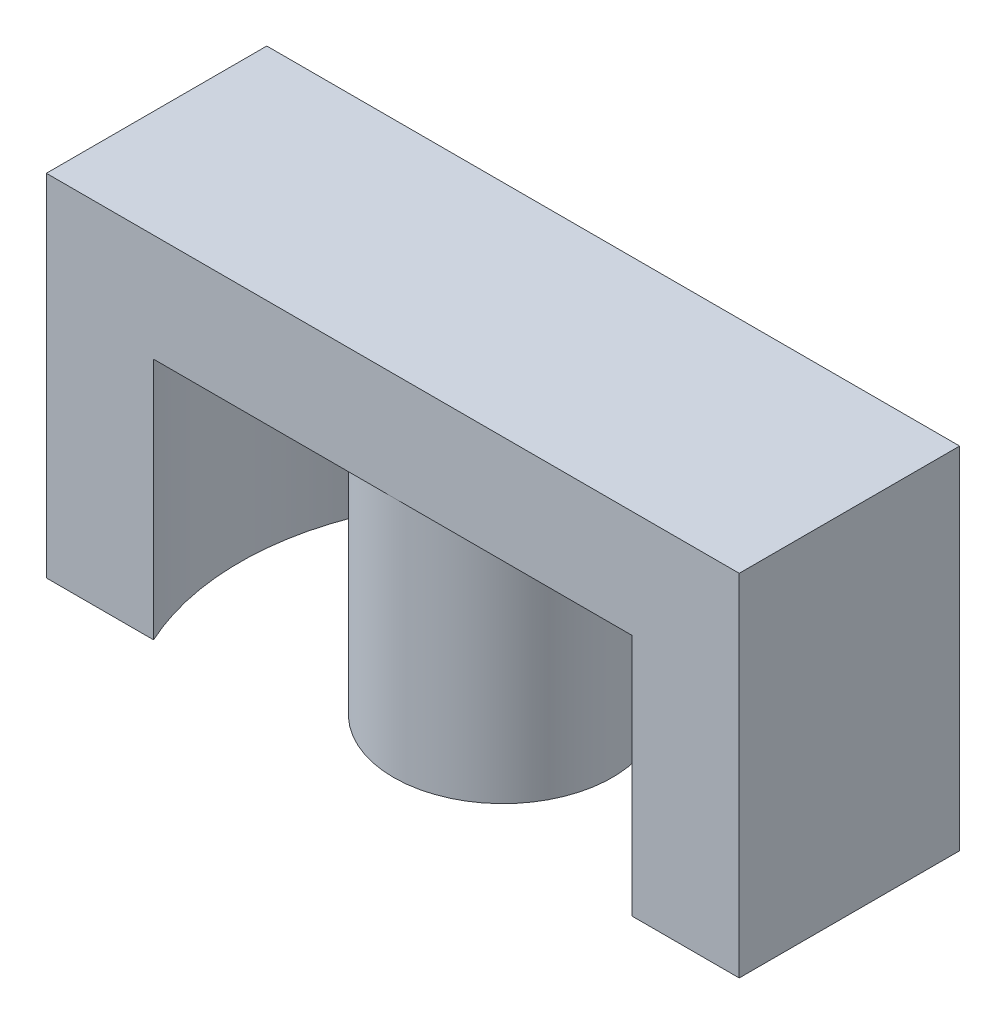
ISO-10303-21;
HEADER;
FILE_DESCRIPTION(('STEP AP214'),'2;1');
FILE_NAME('part.step','',(''),(''),'','','');
FILE_SCHEMA(('AUTOMOTIVE_DESIGN { 1 0 10303 214 1 1 1 1 }'));
ENDSEC;
DATA;
#1=APPLICATION_CONTEXT('core data for automotive mechanical design processes');
#2=APPLICATION_PROTOCOL_DEFINITION('international standard','automotive_design',2000,#1);
#3=PRODUCT_CONTEXT('',#1,'mechanical');
#4=PRODUCT('Part','Part','',(#3));
#5=PRODUCT_RELATED_PRODUCT_CATEGORY('part','',(#4));
#6=PRODUCT_DEFINITION_FORMATION('','',#4);
#7=PRODUCT_DEFINITION_CONTEXT('part definition',#1,'design');
#8=PRODUCT_DEFINITION('design','',#6,#7);
#9=PRODUCT_DEFINITION_SHAPE('','',#8);
#10=(LENGTH_UNIT() NAMED_UNIT(*) SI_UNIT(.MILLI.,.METRE.));
#11=(NAMED_UNIT(*) PLANE_ANGLE_UNIT() SI_UNIT($,.RADIAN.));
#12=(NAMED_UNIT(*) SI_UNIT($,.STERADIAN.) SOLID_ANGLE_UNIT());
#13=UNCERTAINTY_MEASURE_WITH_UNIT(LENGTH_MEASURE(1.E-05),#10,'distance_accuracy_value','');
#14=(GEOMETRIC_REPRESENTATION_CONTEXT(3) GLOBAL_UNCERTAINTY_ASSIGNED_CONTEXT((#13)) GLOBAL_UNIT_ASSIGNED_CONTEXT((#10,
#11,#12)) REPRESENTATION_CONTEXT('',''));
#15=CARTESIAN_POINT('',(0.,0.,0.));
#16=DIRECTION('',(0.,0.,1.));
#17=DIRECTION('',(1.,0.,0.));
#18=AXIS2_PLACEMENT_3D('',#15,#16,#17);
#19=CARTESIAN_POINT('',(0.,-17.3,0.));
#20=DIRECTION('',(0.,1.,0.));
#21=DIRECTION('',(0.,0.,1.));
#22=AXIS2_PLACEMENT_3D('',#19,#20,#21);
#23=PLANE('',#22);
#24=DIRECTION('',(1.,0.,0.));
#25=VECTOR('',#24,1.);
#26=CARTESIAN_POINT('',(-17.1,-17.3,5.44));
#27=LINE('',#26,#25);
#28=CARTESIAN_POINT('',(-17.1,-17.3,5.44));
#29=VERTEX_POINT('',#28);
#30=CARTESIAN_POINT('',(-11.8070487421709,-17.3,5.44000000000001));
#31=VERTEX_POINT('',#30);
#32=EDGE_CURVE('E91',#29,#31,#27,.T.);
#33=ORIENTED_EDGE('',*,*,#32,.F.);
#34=DIRECTION('',(0.,0.,1.));
#35=VECTOR('',#34,1.);
#36=CARTESIAN_POINT('',(-17.1,-17.3,-5.44));
#37=LINE('',#36,#35);
#38=CARTESIAN_POINT('',(-17.1,-17.3,-5.44));
#39=VERTEX_POINT('',#38);
#40=EDGE_CURVE('E86',#39,#29,#37,.T.);
#41=ORIENTED_EDGE('',*,*,#40,.F.);
#42=DIRECTION('',(-1.,0.,0.));
#43=VECTOR('',#42,1.);
#44=CARTESIAN_POINT('',(17.1,-17.3,-5.44));
#45=LINE('',#44,#43);
#46=CARTESIAN_POINT('',(-11.8070487421709,-17.3,-5.44));
#47=VERTEX_POINT('',#46);
#48=EDGE_CURVE('E89',#47,#39,#45,.T.);
#49=ORIENTED_EDGE('',*,*,#48,.F.);
#50=CARTESIAN_POINT('',(0.,-17.3,0.));
#51=DIRECTION('',(0.,-1.,0.));
#52=DIRECTION('',(0.,0.,-1.));
#53=AXIS2_PLACEMENT_3D('',#50,#51,#52);
#54=CIRCLE('',#53,13.);
#55=EDGE_CURVE('E116',#47,#31,#54,.F.);
#56=ORIENTED_EDGE('',*,*,#55,.T.);
#57=EDGE_LOOP('',(#33,#41,#49,#56));
#58=FACE_BOUND('',#57,.T.);
#59=ADVANCED_FACE('F16',(#58),#23,.F.);
#60=CARTESIAN_POINT('',(-17.1,-17.3,-5.44));
#61=DIRECTION('',(-1.,0.,0.));
#62=DIRECTION('',(0.,0.,1.));
#63=AXIS2_PLACEMENT_3D('',#60,#61,#62);
#64=PLANE('',#63);
#65=ORIENTED_EDGE('',*,*,#40,.T.);
#66=DIRECTION('',(0.,1.,0.));
#67=VECTOR('',#66,1.);
#68=CARTESIAN_POINT('',(-17.1,-17.3,5.44));
#69=LINE('',#68,#67);
#70=CARTESIAN_POINT('',(-17.1,0.,5.44));
#71=VERTEX_POINT('',#70);
#72=EDGE_CURVE('E117',#71,#29,#69,.F.);
#73=ORIENTED_EDGE('',*,*,#72,.F.);
#74=DIRECTION('',(0.,0.,1.));
#75=VECTOR('',#74,1.);
#76=CARTESIAN_POINT('',(-17.1,0.,0.));
#77=LINE('',#76,#75);
#78=CARTESIAN_POINT('',(-17.1,0.,-5.44));
#79=VERTEX_POINT('',#78);
#80=EDGE_CURVE('E95',#79,#71,#77,.T.);
#81=ORIENTED_EDGE('',*,*,#80,.F.);
#82=DIRECTION('',(0.,1.,0.));
#83=VECTOR('',#82,1.);
#84=CARTESIAN_POINT('',(-17.1,-17.3,-5.44));
#85=LINE('',#84,#83);
#86=EDGE_CURVE('E98',#39,#79,#85,.T.);
#87=ORIENTED_EDGE('',*,*,#86,.F.);
#88=EDGE_LOOP('',(#65,#73,#81,#87));
#89=FACE_BOUND('',#88,.T.);
#90=ADVANCED_FACE('F99',(#89),#64,.T.);
#91=CARTESIAN_POINT('',(0.,0.,0.));
#92=DIRECTION('',(0.,1.,0.));
#93=DIRECTION('',(0.,0.,1.));
#94=AXIS2_PLACEMENT_3D('',#91,#92,#93);
#95=PLANE('',#94);
#96=ORIENTED_EDGE('',*,*,#80,.T.);
#97=DIRECTION('',(1.,0.,0.));
#98=VECTOR('',#97,1.);
#99=CARTESIAN_POINT('',(-17.1,0.,5.44));
#100=LINE('',#99,#98);
#101=CARTESIAN_POINT('',(17.1,0.,5.44));
#102=VERTEX_POINT('',#101);
#103=EDGE_CURVE('E121',#102,#71,#100,.F.);
#104=ORIENTED_EDGE('',*,*,#103,.F.);
#105=DIRECTION('',(0.,0.,-1.));
#106=VECTOR('',#105,1.);
#107=CARTESIAN_POINT('',(17.1,0.,5.44));
#108=LINE('',#107,#106);
#109=CARTESIAN_POINT('',(17.1,0.,-5.44));
#110=VERTEX_POINT('',#109);
#111=EDGE_CURVE('E163',#110,#102,#108,.F.);
#112=ORIENTED_EDGE('',*,*,#111,.F.);
#113=DIRECTION('',(-1.,0.,0.));
#114=VECTOR('',#113,1.);
#115=CARTESIAN_POINT('',(17.1,0.,-5.44));
#116=LINE('',#115,#114);
#117=EDGE_CURVE('E103',#79,#110,#116,.F.);
#118=ORIENTED_EDGE('',*,*,#117,.F.);
#119=EDGE_LOOP('',(#96,#104,#112,#118));
#120=FACE_BOUND('',#119,.T.);
#121=ADVANCED_FACE('F182',(#120),#95,.T.);
#122=CARTESIAN_POINT('',(17.1,-17.3,5.44));
#123=DIRECTION('',(1.,0.,0.));
#124=DIRECTION('',(0.,0.,-1.));
#125=AXIS2_PLACEMENT_3D('',#122,#123,#124);
#126=PLANE('',#125);
#127=DIRECTION('',(0.,0.,1.));
#128=VECTOR('',#127,1.);
#129=CARTESIAN_POINT('',(17.1,-17.3,0.));
#130=LINE('',#129,#128);
#131=CARTESIAN_POINT('',(17.1,-17.3,5.44));
#132=VERTEX_POINT('',#131);
#133=CARTESIAN_POINT('',(17.1,-17.3,-5.44));
#134=VERTEX_POINT('',#133);
#135=EDGE_CURVE('E65',#132,#134,#130,.F.);
#136=ORIENTED_EDGE('',*,*,#135,.T.);
#137=DIRECTION('',(0.,1.,0.));
#138=VECTOR('',#137,1.);
#139=CARTESIAN_POINT('',(17.1,-17.3,-5.44));
#140=LINE('',#139,#138);
#141=EDGE_CURVE('E159',#110,#134,#140,.F.);
#142=ORIENTED_EDGE('',*,*,#141,.F.);
#143=ORIENTED_EDGE('',*,*,#111,.T.);
#144=DIRECTION('',(0.,1.,0.));
#145=VECTOR('',#144,1.);
#146=CARTESIAN_POINT('',(17.1,-17.3,5.44));
#147=LINE('',#146,#145);
#148=EDGE_CURVE('E126',#132,#102,#147,.T.);
#149=ORIENTED_EDGE('',*,*,#148,.F.);
#150=EDGE_LOOP('',(#136,#142,#143,#149));
#151=FACE_BOUND('',#150,.T.);
#152=ADVANCED_FACE('F185',(#151),#126,.T.);
#153=CARTESIAN_POINT('',(0.,-17.3,0.));
#154=DIRECTION('',(0.,1.,0.));
#155=DIRECTION('',(0.,0.,1.));
#156=AXIS2_PLACEMENT_3D('',#153,#154,#155);
#157=PLANE('',#156);
#158=DIRECTION('',(-1.,0.,0.));
#159=VECTOR('',#158,1.);
#160=CARTESIAN_POINT('',(17.1,-17.3,-5.44));
#161=LINE('',#160,#159);
#162=CARTESIAN_POINT('',(11.8070487421709,-17.3,-5.44));
#163=VERTEX_POINT('',#162);
#164=EDGE_CURVE('E157',#134,#163,#161,.T.);
#165=ORIENTED_EDGE('',*,*,#164,.F.);
#166=ORIENTED_EDGE('',*,*,#135,.F.);
#167=DIRECTION('',(1.,0.,0.));
#168=VECTOR('',#167,1.);
#169=CARTESIAN_POINT('',(-17.1,-17.3,5.44));
#170=LINE('',#169,#168);
#171=CARTESIAN_POINT('',(11.8070487421709,-17.3,5.44));
#172=VERTEX_POINT('',#171);
#173=EDGE_CURVE('E131',#172,#132,#170,.T.);
#174=ORIENTED_EDGE('',*,*,#173,.F.);
#175=CARTESIAN_POINT('',(0.,-17.3,0.));
#176=DIRECTION('',(0.,-1.,0.));
#177=DIRECTION('',(0.,0.,-1.));
#178=AXIS2_PLACEMENT_3D('',#175,#176,#177);
#179=CIRCLE('',#178,13.);
#180=EDGE_CURVE('E19',#172,#163,#179,.F.);
#181=ORIENTED_EDGE('',*,*,#180,.T.);
#182=EDGE_LOOP('',(#165,#166,#174,#181));
#183=FACE_BOUND('',#182,.T.);
#184=ADVANCED_FACE('F188',(#183),#157,.F.);
#185=CARTESIAN_POINT('',(0.,-51.6133889928172,0.));
#186=DIRECTION('',(0.,-1.,0.));
#187=DIRECTION('',(0.,0.,-1.));
#188=AXIS2_PLACEMENT_3D('',#185,#186,#187);
#189=CYLINDRICAL_SURFACE('',#188,13.);
#190=DIRECTION('',(0.,1.,0.));
#191=VECTOR('',#190,1.);
#192=CARTESIAN_POINT('',(11.8070487421709,-17.3,5.44));
#193=LINE('',#192,#191);
#194=CARTESIAN_POINT('',(11.8070487421709,-5.3,5.44));
#195=VERTEX_POINT('',#194);
#196=EDGE_CURVE('E136',#195,#172,#193,.F.);
#197=ORIENTED_EDGE('',*,*,#196,.F.);
#198=CARTESIAN_POINT('',(0.,-5.3,0.));
#199=DIRECTION('',(0.,-1.,0.));
#200=DIRECTION('',(0.,0.,-1.));
#201=AXIS2_PLACEMENT_3D('',#198,#199,#200);
#202=CIRCLE('',#201,13.);
#203=CARTESIAN_POINT('',(11.8070487421709,-5.3,-5.44));
#204=VERTEX_POINT('',#203);
#205=EDGE_CURVE('E146',#204,#195,#202,.T.);
#206=ORIENTED_EDGE('',*,*,#205,.F.);
#207=DIRECTION('',(0.,1.,0.));
#208=VECTOR('',#207,1.);
#209=CARTESIAN_POINT('',(11.8070487421709,-17.3,-5.44));
#210=LINE('',#209,#208);
#211=EDGE_CURVE('E148',#163,#204,#210,.T.);
#212=ORIENTED_EDGE('',*,*,#211,.F.);
#213=ORIENTED_EDGE('',*,*,#180,.F.);
#214=EDGE_LOOP('',(#197,#206,#212,#213));
#215=FACE_BOUND('',#214,.T.);
#216=ADVANCED_FACE('F189',(#215),#189,.F.);
#217=CARTESIAN_POINT('',(-17.1,-17.3,5.44));
#218=DIRECTION('',(0.,0.,1.));
#219=DIRECTION('',(1.,0.,0.));
#220=AXIS2_PLACEMENT_3D('',#217,#218,#219);
#221=PLANE('',#220);
#222=ORIENTED_EDGE('',*,*,#32,.T.);
#223=DIRECTION('',(0.,-1.,0.));
#224=VECTOR('',#223,1.);
#225=CARTESIAN_POINT('',(-11.8070487421709,-51.6133889928172,5.44000000000001));
#226=LINE('',#225,#224);
#227=CARTESIAN_POINT('',(-11.8070487421709,-5.3,5.44000000000001));
#228=VERTEX_POINT('',#227);
#229=EDGE_CURVE('E108',#31,#228,#226,.F.);
#230=ORIENTED_EDGE('',*,*,#229,.T.);
#231=DIRECTION('',(1.,0.,0.));
#232=VECTOR('',#231,1.);
#233=CARTESIAN_POINT('',(0.,-5.3,5.44));
#234=LINE('',#233,#232);
#235=EDGE_CURVE('E145',#195,#228,#234,.F.);
#236=ORIENTED_EDGE('',*,*,#235,.F.);
#237=ORIENTED_EDGE('',*,*,#196,.T.);
#238=ORIENTED_EDGE('',*,*,#173,.T.);
#239=ORIENTED_EDGE('',*,*,#148,.T.);
#240=ORIENTED_EDGE('',*,*,#103,.T.);
#241=ORIENTED_EDGE('',*,*,#72,.T.);
#242=EDGE_LOOP('',(#222,#230,#236,#237,#238,#239,#240,#241));
#243=FACE_BOUND('',#242,.T.);
#244=ADVANCED_FACE('F183',(#243),#221,.T.);
#245=CARTESIAN_POINT('',(0.,-51.6133889928172,0.));
#246=DIRECTION('',(0.,-1.,0.));
#247=DIRECTION('',(0.,0.,-1.));
#248=AXIS2_PLACEMENT_3D('',#245,#246,#247);
#249=CYLINDRICAL_SURFACE('',#248,13.);
#250=ORIENTED_EDGE('',*,*,#229,.F.);
#251=ORIENTED_EDGE('',*,*,#55,.F.);
#252=DIRECTION('',(0.,1.,0.));
#253=VECTOR('',#252,1.);
#254=CARTESIAN_POINT('',(-11.8070487421709,-17.3,-5.44));
#255=LINE('',#254,#253);
#256=CARTESIAN_POINT('',(-11.8070487421709,-5.3,-5.44));
#257=VERTEX_POINT('',#256);
#258=EDGE_CURVE('E34',#257,#47,#255,.F.);
#259=ORIENTED_EDGE('',*,*,#258,.F.);
#260=CARTESIAN_POINT('',(0.,-5.3,0.));
#261=DIRECTION('',(0.,-1.,0.));
#262=DIRECTION('',(0.,0.,-1.));
#263=AXIS2_PLACEMENT_3D('',#260,#261,#262);
#264=CIRCLE('',#263,13.);
#265=EDGE_CURVE('E142',#228,#257,#264,.T.);
#266=ORIENTED_EDGE('',*,*,#265,.F.);
#267=EDGE_LOOP('',(#250,#251,#259,#266));
#268=FACE_BOUND('',#267,.T.);
#269=ADVANCED_FACE('F197',(#268),#249,.F.);
#270=CARTESIAN_POINT('',(17.1,-17.3,-5.44));
#271=DIRECTION('',(0.,0.,-1.));
#272=DIRECTION('',(-1.,0.,0.));
#273=AXIS2_PLACEMENT_3D('',#270,#271,#272);
#274=PLANE('',#273);
#275=ORIENTED_EDGE('',*,*,#164,.T.);
#276=ORIENTED_EDGE('',*,*,#211,.T.);
#277=DIRECTION('',(1.,0.,0.));
#278=VECTOR('',#277,1.);
#279=CARTESIAN_POINT('',(0.,-5.3,-5.44));
#280=LINE('',#279,#278);
#281=EDGE_CURVE('E141',#257,#204,#280,.T.);
#282=ORIENTED_EDGE('',*,*,#281,.F.);
#283=ORIENTED_EDGE('',*,*,#258,.T.);
#284=ORIENTED_EDGE('',*,*,#48,.T.);
#285=ORIENTED_EDGE('',*,*,#86,.T.);
#286=ORIENTED_EDGE('',*,*,#117,.T.);
#287=ORIENTED_EDGE('',*,*,#141,.T.);
#288=EDGE_LOOP('',(#275,#276,#282,#283,#284,#285,#286,#287));
#289=FACE_BOUND('',#288,.T.);
#290=ADVANCED_FACE('F106',(#289),#274,.T.);
#291=CARTESIAN_POINT('',(0.,-17.3,0.));
#292=DIRECTION('',(0.,1.,0.));
#293=DIRECTION('',(0.,0.,1.));
#294=AXIS2_PLACEMENT_3D('',#291,#292,#293);
#295=PLANE('',#294);
#296=CARTESIAN_POINT('',(0.,-17.3,0.));
#297=DIRECTION('',(0.,-1.,0.));
#298=DIRECTION('',(0.,0.,-1.));
#299=AXIS2_PLACEMENT_3D('',#296,#297,#298);
#300=CIRCLE('',#299,5.4);
#301=CARTESIAN_POINT('',(0.,-17.3,-5.4));
#302=VERTEX_POINT('',#301);
#303=EDGE_CURVE('E25',#302,#302,#300,.F.);
#304=ORIENTED_EDGE('',*,*,#303,.F.);
#305=EDGE_LOOP('',(#304));
#306=FACE_BOUND('',#305,.T.);
#307=ADVANCED_FACE('F205',(#306),#295,.F.);
#308=CARTESIAN_POINT('',(0.,-5.3,0.));
#309=DIRECTION('',(0.,-1.,0.));
#310=DIRECTION('',(0.,0.,-1.));
#311=AXIS2_PLACEMENT_3D('',#308,#309,#310);
#312=PLANE('',#311);
#313=ORIENTED_EDGE('',*,*,#265,.T.);
#314=ORIENTED_EDGE('',*,*,#281,.T.);
#315=ORIENTED_EDGE('',*,*,#205,.T.);
#316=ORIENTED_EDGE('',*,*,#235,.T.);
#317=EDGE_LOOP('',(#313,#314,#315,#316));
#318=FACE_BOUND('',#317,.T.);
#319=CARTESIAN_POINT('',(0.,-5.3,0.));
#320=DIRECTION('',(0.,-1.,0.));
#321=DIRECTION('',(0.,0.,-1.));
#322=AXIS2_PLACEMENT_3D('',#319,#320,#321);
#323=CIRCLE('',#322,5.4);
#324=CARTESIAN_POINT('',(0.,-5.3,-5.4));
#325=VERTEX_POINT('',#324);
#326=EDGE_CURVE('E11',#325,#325,#323,.T.);
#327=ORIENTED_EDGE('',*,*,#326,.F.);
#328=EDGE_LOOP('',(#327));
#329=FACE_BOUND('',#328,.T.);
#330=ADVANCED_FACE('F192',(#318,#329),#312,.T.);
#331=CARTESIAN_POINT('',(0.,-51.6133889928172,0.));
#332=DIRECTION('',(0.,-1.,0.));
#333=DIRECTION('',(0.,0.,-1.));
#334=AXIS2_PLACEMENT_3D('',#331,#332,#333);
#335=CYLINDRICAL_SURFACE('',#334,5.4);
#336=ORIENTED_EDGE('',*,*,#326,.T.);
#337=EDGE_LOOP('',(#336));
#338=FACE_BOUND('',#337,.T.);
#339=ORIENTED_EDGE('',*,*,#303,.T.);
#340=EDGE_LOOP('',(#339));
#341=FACE_BOUND('',#340,.T.);
#342=ADVANCED_FACE('F208',(#338,#341),#335,.T.);
#343=CLOSED_SHELL('',(#59,#90,#121,#152,#184,#216,#244,#269,#290,#307,#330,#342));
#344=MANIFOLD_SOLID_BREP('B1',#343);
#345=ADVANCED_BREP_SHAPE_REPRESENTATION('',(#18,#344),#14);
#346=SHAPE_DEFINITION_REPRESENTATION(#9,#345);
ENDSEC;
END-ISO-10303-21;
